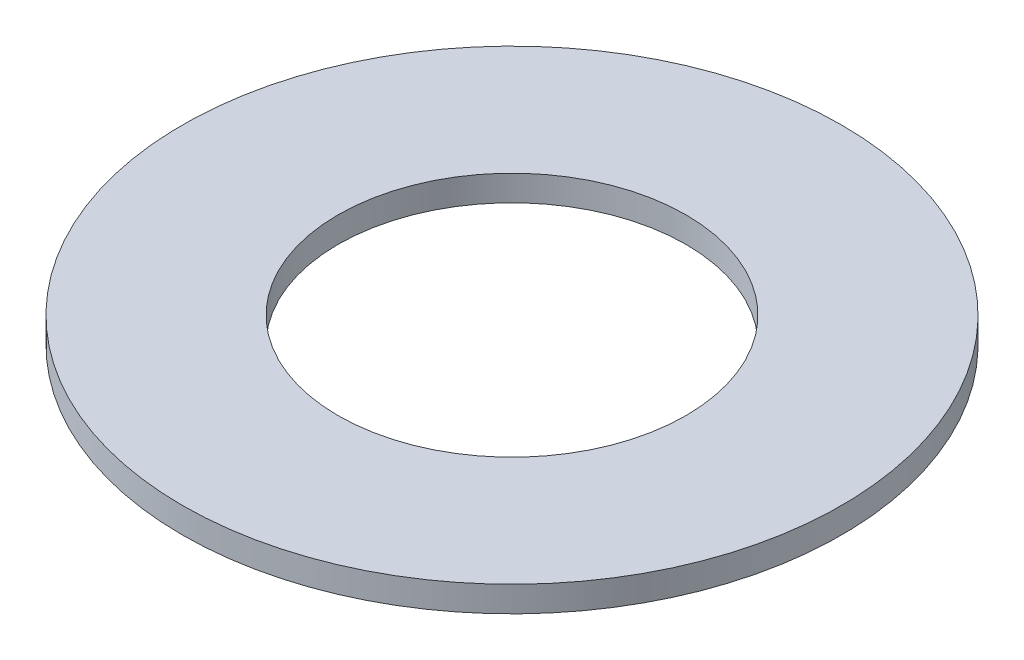
ISO-10303-21;
HEADER;
FILE_DESCRIPTION(('STEP AP214'),'2;1');
FILE_NAME('part.step','',(''),(''),'','','');
FILE_SCHEMA(('AUTOMOTIVE_DESIGN { 1 0 10303 214 1 1 1 1 }'));
ENDSEC;
DATA;
#1=APPLICATION_CONTEXT('core data for automotive mechanical design processes');
#2=APPLICATION_PROTOCOL_DEFINITION('international standard','automotive_design',2000,#1);
#3=PRODUCT_CONTEXT('',#1,'mechanical');
#4=PRODUCT('Part','Part','',(#3));
#5=PRODUCT_RELATED_PRODUCT_CATEGORY('part','',(#4));
#6=PRODUCT_DEFINITION_FORMATION('','',#4);
#7=PRODUCT_DEFINITION_CONTEXT('part definition',#1,'design');
#8=PRODUCT_DEFINITION('design','',#6,#7);
#9=PRODUCT_DEFINITION_SHAPE('','',#8);
#10=(LENGTH_UNIT() NAMED_UNIT(*) SI_UNIT(.MILLI.,.METRE.));
#11=(NAMED_UNIT(*) PLANE_ANGLE_UNIT() SI_UNIT($,.RADIAN.));
#12=(NAMED_UNIT(*) SI_UNIT($,.STERADIAN.) SOLID_ANGLE_UNIT());
#13=UNCERTAINTY_MEASURE_WITH_UNIT(LENGTH_MEASURE(1.E-05),#10,'distance_accuracy_value','');
#14=(GEOMETRIC_REPRESENTATION_CONTEXT(3) GLOBAL_UNCERTAINTY_ASSIGNED_CONTEXT((#13)) GLOBAL_UNIT_ASSIGNED_CONTEXT((#10,
#11,#12)) REPRESENTATION_CONTEXT('',''));
#15=CARTESIAN_POINT('',(0.,0.,0.));
#16=DIRECTION('',(0.,0.,1.));
#17=DIRECTION('',(1.,0.,0.));
#18=AXIS2_PLACEMENT_3D('',#15,#16,#17);
#19=CARTESIAN_POINT('',(0.,7.,0.));
#20=DIRECTION('',(0.,-1.,0.));
#21=DIRECTION('',(0.,0.,-1.));
#22=AXIS2_PLACEMENT_3D('',#19,#20,#21);
#23=CYLINDRICAL_SURFACE('',#22,90.);
#24=CARTESIAN_POINT('',(0.,7.,0.));
#25=DIRECTION('',(0.,1.,0.));
#26=DIRECTION('',(0.,0.,1.));
#27=AXIS2_PLACEMENT_3D('',#24,#25,#26);
#28=CIRCLE('',#27,90.);
#29=CARTESIAN_POINT('',(0.,7.,90.));
#30=VERTEX_POINT('',#29);
#31=EDGE_CURVE('E10',#30,#30,#28,.T.);
#32=ORIENTED_EDGE('',*,*,#31,.F.);
#33=EDGE_LOOP('',(#32));
#34=FACE_BOUND('',#33,.T.);
#35=CARTESIAN_POINT('',(0.,0.,0.));
#36=DIRECTION('',(0.,1.,0.));
#37=DIRECTION('',(0.,0.,1.));
#38=AXIS2_PLACEMENT_3D('',#35,#36,#37);
#39=CIRCLE('',#38,90.);
#40=CARTESIAN_POINT('',(0.,0.,90.));
#41=VERTEX_POINT('',#40);
#42=EDGE_CURVE('E37',#41,#41,#39,.T.);
#43=ORIENTED_EDGE('',*,*,#42,.T.);
#44=EDGE_LOOP('',(#43));
#45=FACE_BOUND('',#44,.T.);
#46=ADVANCED_FACE('F40',(#34,#45),#23,.T.);
#47=CARTESIAN_POINT('',(0.,7.,0.));
#48=DIRECTION('',(0.,1.,0.));
#49=DIRECTION('',(0.,0.,1.));
#50=AXIS2_PLACEMENT_3D('',#47,#48,#49);
#51=PLANE('',#50);
#52=CARTESIAN_POINT('',(0.,7.,0.));
#53=DIRECTION('',(0.,1.,0.));
#54=DIRECTION('',(0.,0.,1.));
#55=AXIS2_PLACEMENT_3D('',#52,#53,#54);
#56=CIRCLE('',#55,47.5);
#57=CARTESIAN_POINT('',(0.,7.,47.5));
#58=VERTEX_POINT('',#57);
#59=EDGE_CURVE('E50',#58,#58,#56,.T.);
#60=ORIENTED_EDGE('',*,*,#59,.F.);
#61=EDGE_LOOP('',(#60));
#62=FACE_BOUND('',#61,.T.);
#63=ORIENTED_EDGE('',*,*,#31,.T.);
#64=EDGE_LOOP('',(#63));
#65=FACE_BOUND('',#64,.T.);
#66=ADVANCED_FACE('F59',(#62,#65),#51,.T.);
#67=CARTESIAN_POINT('',(0.,0.,0.));
#68=DIRECTION('',(0.,1.,0.));
#69=DIRECTION('',(0.,0.,1.));
#70=AXIS2_PLACEMENT_3D('',#67,#68,#69);
#71=PLANE('',#70);
#72=CARTESIAN_POINT('',(0.,0.,0.));
#73=DIRECTION('',(0.,1.,0.));
#74=DIRECTION('',(0.,0.,1.));
#75=AXIS2_PLACEMENT_3D('',#72,#73,#74);
#76=CIRCLE('',#75,47.5);
#77=CARTESIAN_POINT('',(0.,0.,47.5));
#78=VERTEX_POINT('',#77);
#79=EDGE_CURVE('E47',#78,#78,#76,.T.);
#80=ORIENTED_EDGE('',*,*,#79,.T.);
#81=EDGE_LOOP('',(#80));
#82=FACE_BOUND('',#81,.T.);
#83=ORIENTED_EDGE('',*,*,#42,.F.);
#84=EDGE_LOOP('',(#83));
#85=FACE_BOUND('',#84,.T.);
#86=ADVANCED_FACE('F58',(#82,#85),#71,.F.);
#87=CARTESIAN_POINT('',(0.,7.,0.));
#88=DIRECTION('',(0.,-1.,0.));
#89=DIRECTION('',(0.,0.,-1.));
#90=AXIS2_PLACEMENT_3D('',#87,#88,#89);
#91=CYLINDRICAL_SURFACE('',#90,47.5);
#92=ORIENTED_EDGE('',*,*,#59,.T.);
#93=EDGE_LOOP('',(#92));
#94=FACE_BOUND('',#93,.T.);
#95=ORIENTED_EDGE('',*,*,#79,.F.);
#96=EDGE_LOOP('',(#95));
#97=FACE_BOUND('',#96,.T.);
#98=ADVANCED_FACE('F54',(#94,#97),#91,.F.);
#99=CLOSED_SHELL('',(#46,#66,#86,#98));
#100=MANIFOLD_SOLID_BREP('B2',#99);
#101=ADVANCED_BREP_SHAPE_REPRESENTATION('',(#18,#100),#14);
#102=SHAPE_DEFINITION_REPRESENTATION(#9,#101);
ENDSEC;
END-ISO-10303-21;
